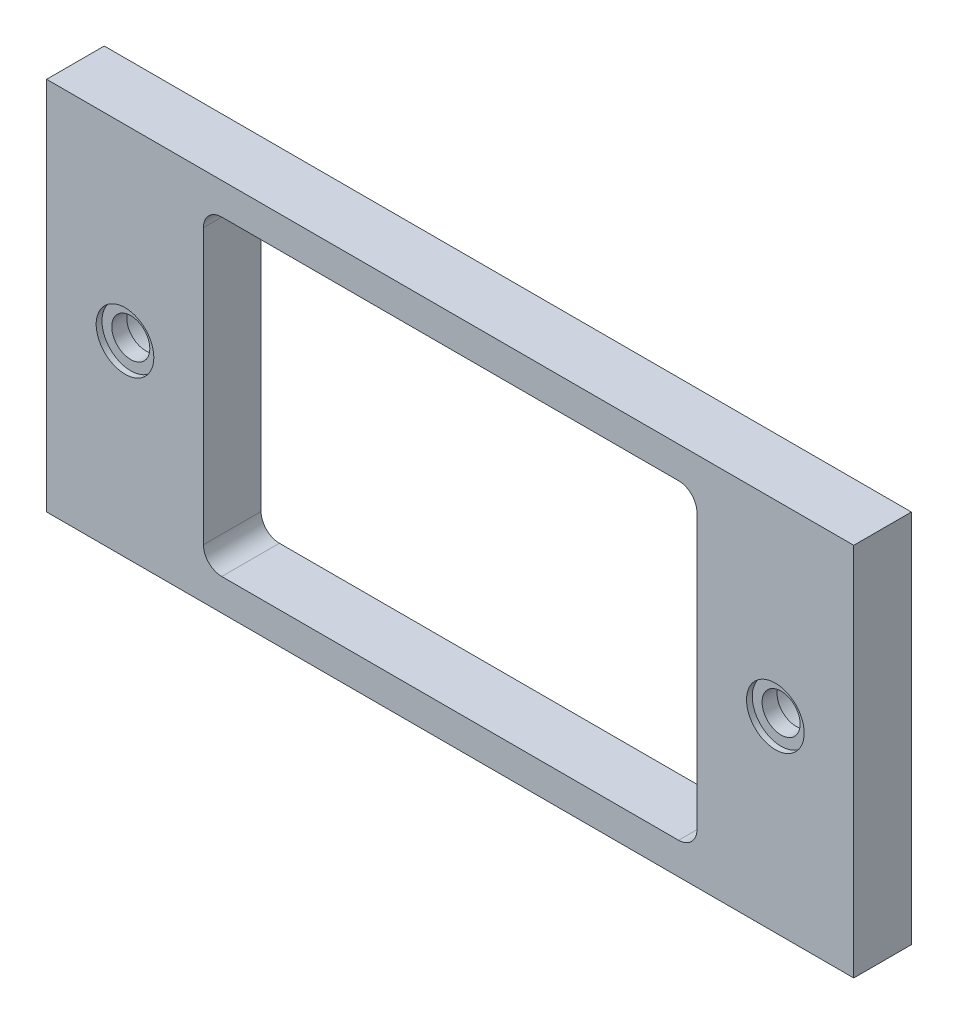
ISO-10303-21;
HEADER;
FILE_DESCRIPTION(('STEP AP214'),'2;1');
FILE_NAME('part.step','',(''),(''),'','','');
FILE_SCHEMA(('AUTOMOTIVE_DESIGN { 1 0 10303 214 1 1 1 1 }'));
ENDSEC;
DATA;
#1=APPLICATION_CONTEXT('core data for automotive mechanical design processes');
#2=APPLICATION_PROTOCOL_DEFINITION('international standard','automotive_design',2000,#1);
#3=PRODUCT_CONTEXT('',#1,'mechanical');
#4=PRODUCT('Part','Part','',(#3));
#5=PRODUCT_RELATED_PRODUCT_CATEGORY('part','',(#4));
#6=PRODUCT_DEFINITION_FORMATION('','',#4);
#7=PRODUCT_DEFINITION_CONTEXT('part definition',#1,'design');
#8=PRODUCT_DEFINITION('design','',#6,#7);
#9=PRODUCT_DEFINITION_SHAPE('','',#8);
#10=(LENGTH_UNIT() NAMED_UNIT(*) SI_UNIT(.MILLI.,.METRE.));
#11=(NAMED_UNIT(*) PLANE_ANGLE_UNIT() SI_UNIT($,.RADIAN.));
#12=(NAMED_UNIT(*) SI_UNIT($,.STERADIAN.) SOLID_ANGLE_UNIT());
#13=UNCERTAINTY_MEASURE_WITH_UNIT(LENGTH_MEASURE(1.E-05),#10,'distance_accuracy_value','');
#14=(GEOMETRIC_REPRESENTATION_CONTEXT(3) GLOBAL_UNCERTAINTY_ASSIGNED_CONTEXT((#13)) GLOBAL_UNIT_ASSIGNED_CONTEXT((#10,
#11,#12)) REPRESENTATION_CONTEXT('',''));
#15=CARTESIAN_POINT('',(0.,0.,0.));
#16=DIRECTION('',(0.,0.,1.));
#17=DIRECTION('',(1.,0.,0.));
#18=AXIS2_PLACEMENT_3D('',#15,#16,#17);
#19=CARTESIAN_POINT('',(126.4,32.5,0.));
#20=DIRECTION('',(0.,0.,-1.));
#21=DIRECTION('',(-1.,0.,0.));
#22=AXIS2_PLACEMENT_3D('',#19,#20,#21);
#23=CYLINDRICAL_SURFACE('',#22,3.3);
#24=CARTESIAN_POINT('',(126.4,32.5,6.4));
#25=DIRECTION('',(0.,0.,-1.));
#26=DIRECTION('',(-1.,0.,0.));
#27=AXIS2_PLACEMENT_3D('',#24,#25,#26);
#28=CIRCLE('',#27,3.3);
#29=CARTESIAN_POINT('',(123.1,32.5,6.4));
#30=VERTEX_POINT('',#29);
#31=EDGE_CURVE('E209',#30,#30,#28,.T.);
#32=ORIENTED_EDGE('',*,*,#31,.T.);
#33=EDGE_LOOP('',(#32));
#34=FACE_BOUND('',#33,.T.);
#35=CARTESIAN_POINT('',(126.4,32.5,9.));
#36=DIRECTION('',(0.,0.,1.));
#37=DIRECTION('',(1.,0.,0.));
#38=AXIS2_PLACEMENT_3D('',#35,#36,#37);
#39=CIRCLE('',#38,3.3);
#40=CARTESIAN_POINT('',(129.7,32.5,9.));
#41=VERTEX_POINT('',#40);
#42=EDGE_CURVE('E39',#41,#41,#39,.F.);
#43=ORIENTED_EDGE('',*,*,#42,.F.);
#44=EDGE_LOOP('',(#43));
#45=FACE_BOUND('',#44,.T.);
#46=ADVANCED_FACE('F35',(#34,#45),#23,.F.);
#47=CARTESIAN_POINT('',(13.6,32.5,0.));
#48=DIRECTION('',(0.,0.,-1.));
#49=DIRECTION('',(-1.,0.,0.));
#50=AXIS2_PLACEMENT_3D('',#47,#48,#49);
#51=CYLINDRICAL_SURFACE('',#50,3.3);
#52=CARTESIAN_POINT('',(13.6,32.5,6.4));
#53=DIRECTION('',(0.,0.,-1.));
#54=DIRECTION('',(-1.,0.,0.));
#55=AXIS2_PLACEMENT_3D('',#52,#53,#54);
#56=CIRCLE('',#55,3.3);
#57=CARTESIAN_POINT('',(10.3,32.5,6.4));
#58=VERTEX_POINT('',#57);
#59=EDGE_CURVE('E218',#58,#58,#56,.T.);
#60=ORIENTED_EDGE('',*,*,#59,.T.);
#61=EDGE_LOOP('',(#60));
#62=FACE_BOUND('',#61,.T.);
#63=CARTESIAN_POINT('',(13.6,32.5,9.));
#64=DIRECTION('',(0.,0.,1.));
#65=DIRECTION('',(1.,0.,0.));
#66=AXIS2_PLACEMENT_3D('',#63,#64,#65);
#67=CIRCLE('',#66,3.3);
#68=CARTESIAN_POINT('',(16.9,32.5,9.));
#69=VERTEX_POINT('',#68);
#70=EDGE_CURVE('E187',#69,#69,#67,.F.);
#71=ORIENTED_EDGE('',*,*,#70,.F.);
#72=EDGE_LOOP('',(#71));
#73=FACE_BOUND('',#72,.T.);
#74=ADVANCED_FACE('F270',(#62,#73),#51,.F.);
#75=CARTESIAN_POINT('',(0.,0.,10.));
#76=DIRECTION('',(1.,0.,0.));
#77=DIRECTION('',(0.,0.,-1.));
#78=AXIS2_PLACEMENT_3D('',#75,#76,#77);
#79=PLANE('',#78);
#80=DIRECTION('',(0.,-1.,0.));
#81=VECTOR('',#80,1.);
#82=CARTESIAN_POINT('',(0.,0.,0.));
#83=LINE('',#82,#81);
#84=CARTESIAN_POINT('',(0.,65.,0.));
#85=VERTEX_POINT('',#84);
#86=CARTESIAN_POINT('',(0.,0.,0.));
#87=VERTEX_POINT('',#86);
#88=EDGE_CURVE('E151',#85,#87,#83,.T.);
#89=ORIENTED_EDGE('',*,*,#88,.T.);
#90=DIRECTION('',(0.,0.,-1.));
#91=VECTOR('',#90,1.);
#92=CARTESIAN_POINT('',(0.,0.,10.));
#93=LINE('',#92,#91);
#94=CARTESIAN_POINT('',(0.,0.,10.));
#95=VERTEX_POINT('',#94);
#96=EDGE_CURVE('E131',#95,#87,#93,.T.);
#97=ORIENTED_EDGE('',*,*,#96,.F.);
#98=DIRECTION('',(0.,-1.,0.));
#99=VECTOR('',#98,1.);
#100=CARTESIAN_POINT('',(0.,0.,10.));
#101=LINE('',#100,#99);
#102=CARTESIAN_POINT('',(0.,65.,10.));
#103=VERTEX_POINT('',#102);
#104=EDGE_CURVE('E138',#103,#95,#101,.T.);
#105=ORIENTED_EDGE('',*,*,#104,.F.);
#106=DIRECTION('',(0.,0.,-1.));
#107=VECTOR('',#106,1.);
#108=CARTESIAN_POINT('',(0.,65.,10.));
#109=LINE('',#108,#107);
#110=EDGE_CURVE('E244',#103,#85,#109,.T.);
#111=ORIENTED_EDGE('',*,*,#110,.T.);
#112=EDGE_LOOP('',(#89,#97,#105,#111));
#113=FACE_BOUND('',#112,.T.);
#114=ADVANCED_FACE('F149',(#113),#79,.F.);
#115=CARTESIAN_POINT('',(0.,0.,10.));
#116=DIRECTION('',(0.,1.,0.));
#117=DIRECTION('',(0.,0.,1.));
#118=AXIS2_PLACEMENT_3D('',#115,#116,#117);
#119=PLANE('',#118);
#120=DIRECTION('',(1.,0.,0.));
#121=VECTOR('',#120,1.);
#122=CARTESIAN_POINT('',(0.,0.,0.));
#123=LINE('',#122,#121);
#124=CARTESIAN_POINT('',(140.,0.,0.));
#125=VERTEX_POINT('',#124);
#126=EDGE_CURVE('E246',#87,#125,#123,.T.);
#127=ORIENTED_EDGE('',*,*,#126,.T.);
#128=DIRECTION('',(0.,0.,-1.));
#129=VECTOR('',#128,1.);
#130=CARTESIAN_POINT('',(140.,0.,10.));
#131=LINE('',#130,#129);
#132=CARTESIAN_POINT('',(140.,0.,10.));
#133=VERTEX_POINT('',#132);
#134=EDGE_CURVE('E134',#133,#125,#131,.T.);
#135=ORIENTED_EDGE('',*,*,#134,.F.);
#136=DIRECTION('',(1.,0.,0.));
#137=VECTOR('',#136,1.);
#138=CARTESIAN_POINT('',(0.,0.,10.));
#139=LINE('',#138,#137);
#140=EDGE_CURVE('E127',#95,#133,#139,.T.);
#141=ORIENTED_EDGE('',*,*,#140,.F.);
#142=ORIENTED_EDGE('',*,*,#96,.T.);
#143=EDGE_LOOP('',(#127,#135,#141,#142));
#144=FACE_BOUND('',#143,.T.);
#145=ADVANCED_FACE('F129',(#144),#119,.F.);
#146=CARTESIAN_POINT('',(140.,0.,10.));
#147=DIRECTION('',(-1.,0.,0.));
#148=DIRECTION('',(0.,0.,1.));
#149=AXIS2_PLACEMENT_3D('',#146,#147,#148);
#150=PLANE('',#149);
#151=DIRECTION('',(0.,1.,0.));
#152=VECTOR('',#151,1.);
#153=CARTESIAN_POINT('',(140.,0.,0.));
#154=LINE('',#153,#152);
#155=CARTESIAN_POINT('',(140.,65.,0.));
#156=VERTEX_POINT('',#155);
#157=EDGE_CURVE('E248',#125,#156,#154,.T.);
#158=ORIENTED_EDGE('',*,*,#157,.T.);
#159=DIRECTION('',(0.,0.,-1.));
#160=VECTOR('',#159,1.);
#161=CARTESIAN_POINT('',(140.,65.,10.));
#162=LINE('',#161,#160);
#163=CARTESIAN_POINT('',(140.,65.,10.));
#164=VERTEX_POINT('',#163);
#165=EDGE_CURVE('E156',#164,#156,#162,.T.);
#166=ORIENTED_EDGE('',*,*,#165,.F.);
#167=DIRECTION('',(0.,1.,0.));
#168=VECTOR('',#167,1.);
#169=CARTESIAN_POINT('',(140.,0.,10.));
#170=LINE('',#169,#168);
#171=EDGE_CURVE('E137',#133,#164,#170,.T.);
#172=ORIENTED_EDGE('',*,*,#171,.F.);
#173=ORIENTED_EDGE('',*,*,#134,.T.);
#174=EDGE_LOOP('',(#158,#166,#172,#173));
#175=FACE_BOUND('',#174,.T.);
#176=ADVANCED_FACE('F260',(#175),#150,.F.);
#177=CARTESIAN_POINT('',(0.,65.,10.));
#178=DIRECTION('',(0.,-1.,0.));
#179=DIRECTION('',(0.,0.,-1.));
#180=AXIS2_PLACEMENT_3D('',#177,#178,#179);
#181=PLANE('',#180);
#182=DIRECTION('',(-1.,0.,0.));
#183=VECTOR('',#182,1.);
#184=CARTESIAN_POINT('',(0.,65.,0.));
#185=LINE('',#184,#183);
#186=EDGE_CURVE('E147',#156,#85,#185,.T.);
#187=ORIENTED_EDGE('',*,*,#186,.T.);
#188=ORIENTED_EDGE('',*,*,#110,.F.);
#189=DIRECTION('',(-1.,0.,0.));
#190=VECTOR('',#189,1.);
#191=CARTESIAN_POINT('',(0.,65.,10.));
#192=LINE('',#191,#190);
#193=EDGE_CURVE('E143',#164,#103,#192,.T.);
#194=ORIENTED_EDGE('',*,*,#193,.F.);
#195=ORIENTED_EDGE('',*,*,#165,.T.);
#196=EDGE_LOOP('',(#187,#188,#194,#195));
#197=FACE_BOUND('',#196,.T.);
#198=ADVANCED_FACE('F255',(#197),#181,.F.);
#199=CARTESIAN_POINT('',(0.,0.,10.));
#200=DIRECTION('',(0.,0.,-1.));
#201=DIRECTION('',(-1.,0.,0.));
#202=AXIS2_PLACEMENT_3D('',#199,#200,#201);
#203=PLANE('',#202);
#204=CARTESIAN_POINT('',(126.4,32.5,10.));
#205=DIRECTION('',(0.,0.,1.));
#206=DIRECTION('',(1.,0.,0.));
#207=AXIS2_PLACEMENT_3D('',#204,#205,#206);
#208=CIRCLE('',#207,5.00000000000002);
#209=CARTESIAN_POINT('',(131.4,32.5,10.));
#210=VERTEX_POINT('',#209);
#211=EDGE_CURVE('E204',#210,#210,#208,.T.);
#212=ORIENTED_EDGE('',*,*,#211,.F.);
#213=EDGE_LOOP('',(#212));
#214=FACE_BOUND('',#213,.T.);
#215=CARTESIAN_POINT('',(13.6,32.5,10.));
#216=DIRECTION('',(0.,0.,1.));
#217=DIRECTION('',(1.,0.,0.));
#218=AXIS2_PLACEMENT_3D('',#215,#216,#217);
#219=CIRCLE('',#218,5.);
#220=CARTESIAN_POINT('',(18.6,32.5,10.));
#221=VERTEX_POINT('',#220);
#222=EDGE_CURVE('E197',#221,#221,#219,.T.);
#223=ORIENTED_EDGE('',*,*,#222,.F.);
#224=EDGE_LOOP('',(#223));
#225=FACE_BOUND('',#224,.T.);
#226=DIRECTION('',(1.,0.,0.));
#227=VECTOR('',#226,1.);
#228=CARTESIAN_POINT('',(27.2,5.50000000000001,10.));
#229=LINE('',#228,#227);
#230=CARTESIAN_POINT('',(30.38,5.50000000000001,10.));
#231=VERTEX_POINT('',#230);
#232=CARTESIAN_POINT('',(109.62,5.50000000000001,10.));
#233=VERTEX_POINT('',#232);
#234=EDGE_CURVE('E235',#231,#233,#229,.T.);
#235=ORIENTED_EDGE('',*,*,#234,.F.);
#236=CARTESIAN_POINT('',(30.38,8.68000000000001,10.));
#237=DIRECTION('',(0.,0.,-1.));
#238=DIRECTION('',(-1.,0.,0.));
#239=AXIS2_PLACEMENT_3D('',#236,#237,#238);
#240=CIRCLE('',#239,3.18);
#241=CARTESIAN_POINT('',(27.2,8.68000000000001,10.));
#242=VERTEX_POINT('',#241);
#243=EDGE_CURVE('E180',#231,#242,#240,.T.);
#244=ORIENTED_EDGE('',*,*,#243,.T.);
#245=DIRECTION('',(0.,-1.,0.));
#246=VECTOR('',#245,1.);
#247=CARTESIAN_POINT('',(27.2,59.5,10.));
#248=LINE('',#247,#246);
#249=CARTESIAN_POINT('',(27.2,56.32,10.));
#250=VERTEX_POINT('',#249);
#251=EDGE_CURVE('E221',#250,#242,#248,.T.);
#252=ORIENTED_EDGE('',*,*,#251,.F.);
#253=CARTESIAN_POINT('',(30.38,56.32,10.));
#254=DIRECTION('',(0.,0.,-1.));
#255=DIRECTION('',(-1.,0.,0.));
#256=AXIS2_PLACEMENT_3D('',#253,#254,#255);
#257=CIRCLE('',#256,3.18);
#258=CARTESIAN_POINT('',(30.38,59.5,10.));
#259=VERTEX_POINT('',#258);
#260=EDGE_CURVE('E44',#250,#259,#257,.T.);
#261=ORIENTED_EDGE('',*,*,#260,.T.);
#262=DIRECTION('',(-1.,0.,0.));
#263=VECTOR('',#262,1.);
#264=CARTESIAN_POINT('',(27.2,59.5,10.));
#265=LINE('',#264,#263);
#266=CARTESIAN_POINT('',(109.62,59.5,10.));
#267=VERTEX_POINT('',#266);
#268=EDGE_CURVE('E226',#267,#259,#265,.T.);
#269=ORIENTED_EDGE('',*,*,#268,.F.);
#270=CARTESIAN_POINT('',(109.62,56.32,10.));
#271=DIRECTION('',(0.,0.,-1.));
#272=DIRECTION('',(-1.,0.,0.));
#273=AXIS2_PLACEMENT_3D('',#270,#271,#272);
#274=CIRCLE('',#273,3.18);
#275=CARTESIAN_POINT('',(112.8,56.32,10.));
#276=VERTEX_POINT('',#275);
#277=EDGE_CURVE('E184',#267,#276,#274,.T.);
#278=ORIENTED_EDGE('',*,*,#277,.T.);
#279=DIRECTION('',(0.,1.,0.));
#280=VECTOR('',#279,1.);
#281=CARTESIAN_POINT('',(112.8,59.5,10.));
#282=LINE('',#281,#280);
#283=CARTESIAN_POINT('',(112.8,8.68000000000001,10.));
#284=VERTEX_POINT('',#283);
#285=EDGE_CURVE('E238',#284,#276,#282,.T.);
#286=ORIENTED_EDGE('',*,*,#285,.F.);
#287=CARTESIAN_POINT('',(109.62,8.68000000000001,10.));
#288=DIRECTION('',(0.,0.,-1.));
#289=DIRECTION('',(-1.,0.,0.));
#290=AXIS2_PLACEMENT_3D('',#287,#288,#289);
#291=CIRCLE('',#290,3.18);
#292=EDGE_CURVE('E176',#284,#233,#291,.T.);
#293=ORIENTED_EDGE('',*,*,#292,.T.);
#294=EDGE_LOOP('',(#235,#244,#252,#261,#269,#278,#286,#293));
#295=FACE_BOUND('',#294,.T.);
#296=ORIENTED_EDGE('',*,*,#104,.T.);
#297=ORIENTED_EDGE('',*,*,#140,.T.);
#298=ORIENTED_EDGE('',*,*,#171,.T.);
#299=ORIENTED_EDGE('',*,*,#193,.T.);
#300=EDGE_LOOP('',(#296,#297,#298,#299));
#301=FACE_BOUND('',#300,.T.);
#302=ADVANCED_FACE('F141',(#214,#225,#295,#301),#203,.F.);
#303=CARTESIAN_POINT('',(0.,0.,0.));
#304=DIRECTION('',(0.,0.,-1.));
#305=DIRECTION('',(-1.,0.,0.));
#306=AXIS2_PLACEMENT_3D('',#303,#304,#305);
#307=PLANE('',#306);
#308=CARTESIAN_POINT('',(126.4,32.5,0.));
#309=DIRECTION('',(0.,0.,-1.));
#310=DIRECTION('',(-1.,0.,0.));
#311=AXIS2_PLACEMENT_3D('',#308,#309,#310);
#312=CIRCLE('',#311,5.50000000000001);
#313=CARTESIAN_POINT('',(120.9,32.5,0.));
#314=VERTEX_POINT('',#313);
#315=EDGE_CURVE('E189',#314,#314,#312,.T.);
#316=ORIENTED_EDGE('',*,*,#315,.F.);
#317=EDGE_LOOP('',(#316));
#318=FACE_BOUND('',#317,.T.);
#319=CARTESIAN_POINT('',(13.6,32.5,0.));
#320=DIRECTION('',(0.,0.,-1.));
#321=DIRECTION('',(-1.,0.,0.));
#322=AXIS2_PLACEMENT_3D('',#319,#320,#321);
#323=CIRCLE('',#322,5.5);
#324=CARTESIAN_POINT('',(8.09999999999997,32.5,0.));
#325=VERTEX_POINT('',#324);
#326=EDGE_CURVE('E212',#325,#325,#323,.T.);
#327=ORIENTED_EDGE('',*,*,#326,.F.);
#328=EDGE_LOOP('',(#327));
#329=FACE_BOUND('',#328,.T.);
#330=DIRECTION('',(-1.,0.,0.));
#331=VECTOR('',#330,1.);
#332=CARTESIAN_POINT('',(27.2,59.5,0.));
#333=LINE('',#332,#331);
#334=CARTESIAN_POINT('',(109.62,59.5,0.));
#335=VERTEX_POINT('',#334);
#336=CARTESIAN_POINT('',(30.38,59.5,0.));
#337=VERTEX_POINT('',#336);
#338=EDGE_CURVE('E231',#335,#337,#333,.T.);
#339=ORIENTED_EDGE('',*,*,#338,.T.);
#340=CARTESIAN_POINT('',(30.38,56.32,0.));
#341=DIRECTION('',(0.,0.,-1.));
#342=DIRECTION('',(-1.,0.,0.));
#343=AXIS2_PLACEMENT_3D('',#340,#341,#342);
#344=CIRCLE('',#343,3.18);
#345=CARTESIAN_POINT('',(27.2,56.32,0.));
#346=VERTEX_POINT('',#345);
#347=EDGE_CURVE('E11',#337,#346,#344,.F.);
#348=ORIENTED_EDGE('',*,*,#347,.T.);
#349=DIRECTION('',(0.,-1.,0.));
#350=VECTOR('',#349,1.);
#351=CARTESIAN_POINT('',(27.2,59.5,0.));
#352=LINE('',#351,#350);
#353=CARTESIAN_POINT('',(27.2,8.68000000000001,0.));
#354=VERTEX_POINT('',#353);
#355=EDGE_CURVE('E222',#346,#354,#352,.T.);
#356=ORIENTED_EDGE('',*,*,#355,.T.);
#357=CARTESIAN_POINT('',(30.38,8.68000000000001,0.));
#358=DIRECTION('',(0.,0.,-1.));
#359=DIRECTION('',(-1.,0.,0.));
#360=AXIS2_PLACEMENT_3D('',#357,#358,#359);
#361=CIRCLE('',#360,3.18);
#362=CARTESIAN_POINT('',(30.38,5.50000000000001,0.));
#363=VERTEX_POINT('',#362);
#364=EDGE_CURVE('E182',#354,#363,#361,.F.);
#365=ORIENTED_EDGE('',*,*,#364,.T.);
#366=DIRECTION('',(1.,0.,0.));
#367=VECTOR('',#366,1.);
#368=CARTESIAN_POINT('',(27.2,5.50000000000001,0.));
#369=LINE('',#368,#367);
#370=CARTESIAN_POINT('',(109.62,5.50000000000001,0.));
#371=VERTEX_POINT('',#370);
#372=EDGE_CURVE('E225',#363,#371,#369,.T.);
#373=ORIENTED_EDGE('',*,*,#372,.T.);
#374=CARTESIAN_POINT('',(109.62,8.68000000000001,0.));
#375=DIRECTION('',(0.,0.,-1.));
#376=DIRECTION('',(-1.,0.,0.));
#377=AXIS2_PLACEMENT_3D('',#374,#375,#376);
#378=CIRCLE('',#377,3.18);
#379=CARTESIAN_POINT('',(112.8,8.68000000000001,0.));
#380=VERTEX_POINT('',#379);
#381=EDGE_CURVE('E178',#371,#380,#378,.F.);
#382=ORIENTED_EDGE('',*,*,#381,.T.);
#383=DIRECTION('',(0.,1.,0.));
#384=VECTOR('',#383,1.);
#385=CARTESIAN_POINT('',(112.8,59.5,0.));
#386=LINE('',#385,#384);
#387=CARTESIAN_POINT('',(112.8,56.32,0.));
#388=VERTEX_POINT('',#387);
#389=EDGE_CURVE('E229',#380,#388,#386,.T.);
#390=ORIENTED_EDGE('',*,*,#389,.T.);
#391=CARTESIAN_POINT('',(109.62,56.32,0.));
#392=DIRECTION('',(0.,0.,-1.));
#393=DIRECTION('',(-1.,0.,0.));
#394=AXIS2_PLACEMENT_3D('',#391,#392,#393);
#395=CIRCLE('',#394,3.18);
#396=EDGE_CURVE('E59',#388,#335,#395,.F.);
#397=ORIENTED_EDGE('',*,*,#396,.T.);
#398=EDGE_LOOP('',(#339,#348,#356,#365,#373,#382,#390,#397));
#399=FACE_BOUND('',#398,.T.);
#400=ORIENTED_EDGE('',*,*,#88,.F.);
#401=ORIENTED_EDGE('',*,*,#186,.F.);
#402=ORIENTED_EDGE('',*,*,#157,.F.);
#403=ORIENTED_EDGE('',*,*,#126,.F.);
#404=EDGE_LOOP('',(#400,#401,#402,#403));
#405=FACE_BOUND('',#404,.T.);
#406=ADVANCED_FACE('F259',(#318,#329,#399,#405),#307,.T.);
#407=CARTESIAN_POINT('',(27.2,59.5,0.));
#408=DIRECTION('',(-1.,0.,0.));
#409=DIRECTION('',(0.,0.,1.));
#410=AXIS2_PLACEMENT_3D('',#407,#408,#409);
#411=PLANE('',#410);
#412=ORIENTED_EDGE('',*,*,#251,.T.);
#413=DIRECTION('',(0.,0.,1.));
#414=VECTOR('',#413,1.);
#415=CARTESIAN_POINT('',(27.2,8.68000000000001,0.));
#416=LINE('',#415,#414);
#417=EDGE_CURVE('E170',#242,#354,#416,.F.);
#418=ORIENTED_EDGE('',*,*,#417,.T.);
#419=ORIENTED_EDGE('',*,*,#355,.F.);
#420=DIRECTION('',(0.,0.,1.));
#421=VECTOR('',#420,1.);
#422=CARTESIAN_POINT('',(27.2,56.32,10.));
#423=LINE('',#422,#421);
#424=EDGE_CURVE('E167',#346,#250,#423,.T.);
#425=ORIENTED_EDGE('',*,*,#424,.T.);
#426=EDGE_LOOP('',(#412,#418,#419,#425));
#427=FACE_BOUND('',#426,.T.);
#428=ADVANCED_FACE('F295',(#427),#411,.F.);
#429=CARTESIAN_POINT('',(27.2,59.5,0.));
#430=DIRECTION('',(0.,1.,0.));
#431=DIRECTION('',(-1.,0.,0.));
#432=AXIS2_PLACEMENT_3D('',#429,#430,#431);
#433=PLANE('',#432);
#434=ORIENTED_EDGE('',*,*,#338,.F.);
#435=DIRECTION('',(0.,0.,1.));
#436=VECTOR('',#435,1.);
#437=CARTESIAN_POINT('',(109.62,59.5,10.));
#438=LINE('',#437,#436);
#439=EDGE_CURVE('E173',#335,#267,#438,.T.);
#440=ORIENTED_EDGE('',*,*,#439,.T.);
#441=ORIENTED_EDGE('',*,*,#268,.T.);
#442=DIRECTION('',(0.,0.,1.));
#443=VECTOR('',#442,1.);
#444=CARTESIAN_POINT('',(30.38,59.5,0.));
#445=LINE('',#444,#443);
#446=EDGE_CURVE('E52',#259,#337,#445,.F.);
#447=ORIENTED_EDGE('',*,*,#446,.T.);
#448=EDGE_LOOP('',(#434,#440,#441,#447));
#449=FACE_BOUND('',#448,.T.);
#450=ADVANCED_FACE('F291',(#449),#433,.F.);
#451=CARTESIAN_POINT('',(112.8,59.5,0.));
#452=DIRECTION('',(1.,0.,0.));
#453=DIRECTION('',(0.,0.,-1.));
#454=AXIS2_PLACEMENT_3D('',#451,#452,#453);
#455=PLANE('',#454);
#456=ORIENTED_EDGE('',*,*,#389,.F.);
#457=DIRECTION('',(0.,0.,1.));
#458=VECTOR('',#457,1.);
#459=CARTESIAN_POINT('',(112.8,8.68000000000001,10.));
#460=LINE('',#459,#458);
#461=EDGE_CURVE('E154',#380,#284,#460,.T.);
#462=ORIENTED_EDGE('',*,*,#461,.T.);
#463=ORIENTED_EDGE('',*,*,#285,.T.);
#464=DIRECTION('',(0.,0.,1.));
#465=VECTOR('',#464,1.);
#466=CARTESIAN_POINT('',(112.8,56.32,0.));
#467=LINE('',#466,#465);
#468=EDGE_CURVE('E152',#276,#388,#467,.F.);
#469=ORIENTED_EDGE('',*,*,#468,.T.);
#470=EDGE_LOOP('',(#456,#462,#463,#469));
#471=FACE_BOUND('',#470,.T.);
#472=ADVANCED_FACE('F294',(#471),#455,.F.);
#473=CARTESIAN_POINT('',(27.2,5.50000000000001,0.));
#474=DIRECTION('',(0.,-1.,0.));
#475=DIRECTION('',(0.,0.,-1.));
#476=AXIS2_PLACEMENT_3D('',#473,#474,#475);
#477=PLANE('',#476);
#478=ORIENTED_EDGE('',*,*,#234,.T.);
#479=DIRECTION('',(0.,0.,1.));
#480=VECTOR('',#479,1.);
#481=CARTESIAN_POINT('',(109.62,5.50000000000001,0.));
#482=LINE('',#481,#480);
#483=EDGE_CURVE('E165',#233,#371,#482,.F.);
#484=ORIENTED_EDGE('',*,*,#483,.T.);
#485=ORIENTED_EDGE('',*,*,#372,.F.);
#486=DIRECTION('',(0.,0.,1.));
#487=VECTOR('',#486,1.);
#488=CARTESIAN_POINT('',(30.38,5.50000000000001,10.));
#489=LINE('',#488,#487);
#490=EDGE_CURVE('E162',#363,#231,#489,.T.);
#491=ORIENTED_EDGE('',*,*,#490,.T.);
#492=EDGE_LOOP('',(#478,#484,#485,#491));
#493=FACE_BOUND('',#492,.T.);
#494=ADVANCED_FACE('F298',(#493),#477,.F.);
#495=CARTESIAN_POINT('',(109.62,8.68000000000001,0.));
#496=DIRECTION('',(0.,0.,-1.));
#497=DIRECTION('',(-1.,0.,0.));
#498=AXIS2_PLACEMENT_3D('',#495,#496,#497);
#499=CYLINDRICAL_SURFACE('',#498,3.18);
#500=ORIENTED_EDGE('',*,*,#381,.F.);
#501=ORIENTED_EDGE('',*,*,#483,.F.);
#502=ORIENTED_EDGE('',*,*,#292,.F.);
#503=ORIENTED_EDGE('',*,*,#461,.F.);
#504=EDGE_LOOP('',(#500,#501,#502,#503));
#505=FACE_BOUND('',#504,.T.);
#506=ADVANCED_FACE('F302',(#505),#499,.F.);
#507=CARTESIAN_POINT('',(30.38,8.68000000000001,0.));
#508=DIRECTION('',(0.,0.,-1.));
#509=DIRECTION('',(-1.,0.,0.));
#510=AXIS2_PLACEMENT_3D('',#507,#508,#509);
#511=CYLINDRICAL_SURFACE('',#510,3.18);
#512=ORIENTED_EDGE('',*,*,#364,.F.);
#513=ORIENTED_EDGE('',*,*,#417,.F.);
#514=ORIENTED_EDGE('',*,*,#243,.F.);
#515=ORIENTED_EDGE('',*,*,#490,.F.);
#516=EDGE_LOOP('',(#512,#513,#514,#515));
#517=FACE_BOUND('',#516,.T.);
#518=ADVANCED_FACE('F330',(#517),#511,.F.);
#519=CARTESIAN_POINT('',(109.62,56.32,0.));
#520=DIRECTION('',(0.,0.,-1.));
#521=DIRECTION('',(-1.,0.,0.));
#522=AXIS2_PLACEMENT_3D('',#519,#520,#521);
#523=CYLINDRICAL_SURFACE('',#522,3.18);
#524=ORIENTED_EDGE('',*,*,#396,.F.);
#525=ORIENTED_EDGE('',*,*,#468,.F.);
#526=ORIENTED_EDGE('',*,*,#277,.F.);
#527=ORIENTED_EDGE('',*,*,#439,.F.);
#528=EDGE_LOOP('',(#524,#525,#526,#527));
#529=FACE_BOUND('',#528,.T.);
#530=ADVANCED_FACE('F340',(#529),#523,.F.);
#531=CARTESIAN_POINT('',(30.38,56.32,0.));
#532=DIRECTION('',(0.,0.,-1.));
#533=DIRECTION('',(-1.,0.,0.));
#534=AXIS2_PLACEMENT_3D('',#531,#532,#533);
#535=CYLINDRICAL_SURFACE('',#534,3.18);
#536=ORIENTED_EDGE('',*,*,#347,.F.);
#537=ORIENTED_EDGE('',*,*,#446,.F.);
#538=ORIENTED_EDGE('',*,*,#260,.F.);
#539=ORIENTED_EDGE('',*,*,#424,.F.);
#540=EDGE_LOOP('',(#536,#537,#538,#539));
#541=FACE_BOUND('',#540,.T.);
#542=ADVANCED_FACE('F37',(#541),#535,.F.);
#543=CARTESIAN_POINT('',(16.9,32.5,6.4));
#544=DIRECTION('',(0.,0.,1.));
#545=DIRECTION('',(1.,0.,0.));
#546=AXIS2_PLACEMENT_3D('',#543,#544,#545);
#547=PLANE('',#546);
#548=ORIENTED_EDGE('',*,*,#59,.F.);
#549=EDGE_LOOP('',(#548));
#550=FACE_BOUND('',#549,.T.);
#551=CARTESIAN_POINT('',(13.6,32.5,6.4));
#552=DIRECTION('',(0.,0.,-1.));
#553=DIRECTION('',(-1.,0.,0.));
#554=AXIS2_PLACEMENT_3D('',#551,#552,#553);
#555=CIRCLE('',#554,5.5);
#556=CARTESIAN_POINT('',(8.09999999999997,32.5,6.4));
#557=VERTEX_POINT('',#556);
#558=EDGE_CURVE('E215',#557,#557,#555,.T.);
#559=ORIENTED_EDGE('',*,*,#558,.T.);
#560=EDGE_LOOP('',(#559));
#561=FACE_BOUND('',#560,.T.);
#562=ADVANCED_FACE('F286',(#550,#561),#547,.F.);
#563=CARTESIAN_POINT('',(13.6,32.5,0.));
#564=DIRECTION('',(0.,0.,-1.));
#565=DIRECTION('',(-1.,0.,0.));
#566=AXIS2_PLACEMENT_3D('',#563,#564,#565);
#567=CYLINDRICAL_SURFACE('',#566,5.5);
#568=ORIENTED_EDGE('',*,*,#558,.F.);
#569=EDGE_LOOP('',(#568));
#570=FACE_BOUND('',#569,.T.);
#571=ORIENTED_EDGE('',*,*,#326,.T.);
#572=EDGE_LOOP('',(#571));
#573=FACE_BOUND('',#572,.T.);
#574=ADVANCED_FACE('F283',(#570,#573),#567,.F.);
#575=CARTESIAN_POINT('',(129.7,32.5,6.4));
#576=DIRECTION('',(0.,0.,1.));
#577=DIRECTION('',(1.,0.,0.));
#578=AXIS2_PLACEMENT_3D('',#575,#576,#577);
#579=PLANE('',#578);
#580=ORIENTED_EDGE('',*,*,#31,.F.);
#581=EDGE_LOOP('',(#580));
#582=FACE_BOUND('',#581,.T.);
#583=CARTESIAN_POINT('',(126.4,32.5,6.4));
#584=DIRECTION('',(0.,0.,-1.));
#585=DIRECTION('',(-1.,0.,0.));
#586=AXIS2_PLACEMENT_3D('',#583,#584,#585);
#587=CIRCLE('',#586,5.50000000000001);
#588=CARTESIAN_POINT('',(120.9,32.5,6.4));
#589=VERTEX_POINT('',#588);
#590=EDGE_CURVE('E194',#589,#589,#587,.T.);
#591=ORIENTED_EDGE('',*,*,#590,.T.);
#592=EDGE_LOOP('',(#591));
#593=FACE_BOUND('',#592,.T.);
#594=ADVANCED_FACE('F281',(#582,#593),#579,.F.);
#595=CARTESIAN_POINT('',(126.4,32.5,0.));
#596=DIRECTION('',(0.,0.,-1.));
#597=DIRECTION('',(-1.,0.,0.));
#598=AXIS2_PLACEMENT_3D('',#595,#596,#597);
#599=CYLINDRICAL_SURFACE('',#598,5.50000000000001);
#600=ORIENTED_EDGE('',*,*,#590,.F.);
#601=EDGE_LOOP('',(#600));
#602=FACE_BOUND('',#601,.T.);
#603=ORIENTED_EDGE('',*,*,#315,.T.);
#604=EDGE_LOOP('',(#603));
#605=FACE_BOUND('',#604,.T.);
#606=ADVANCED_FACE('F441',(#602,#605),#599,.F.);
#607=CARTESIAN_POINT('',(13.6,32.5,9.));
#608=DIRECTION('',(0.,0.,1.));
#609=DIRECTION('',(1.,0.,0.));
#610=AXIS2_PLACEMENT_3D('',#607,#608,#609);
#611=PLANE('',#610);
#612=CARTESIAN_POINT('',(13.6,32.5,9.));
#613=DIRECTION('',(0.,0.,1.));
#614=DIRECTION('',(1.,0.,0.));
#615=AXIS2_PLACEMENT_3D('',#612,#613,#614);
#616=CIRCLE('',#615,5.);
#617=CARTESIAN_POINT('',(18.6,32.5,9.));
#618=VERTEX_POINT('',#617);
#619=EDGE_CURVE('E190',#618,#618,#616,.T.);
#620=ORIENTED_EDGE('',*,*,#619,.T.);
#621=EDGE_LOOP('',(#620));
#622=FACE_BOUND('',#621,.T.);
#623=ORIENTED_EDGE('',*,*,#70,.T.);
#624=EDGE_LOOP('',(#623));
#625=FACE_BOUND('',#624,.T.);
#626=ADVANCED_FACE('F449',(#622,#625),#611,.T.);
#627=CARTESIAN_POINT('',(13.6,32.5,9.));
#628=DIRECTION('',(0.,0.,1.));
#629=DIRECTION('',(1.,0.,0.));
#630=AXIS2_PLACEMENT_3D('',#627,#628,#629);
#631=CYLINDRICAL_SURFACE('',#630,5.);
#632=ORIENTED_EDGE('',*,*,#619,.F.);
#633=EDGE_LOOP('',(#632));
#634=FACE_BOUND('',#633,.T.);
#635=ORIENTED_EDGE('',*,*,#222,.T.);
#636=EDGE_LOOP('',(#635));
#637=FACE_BOUND('',#636,.T.);
#638=ADVANCED_FACE('F472',(#634,#637),#631,.F.);
#639=CARTESIAN_POINT('',(126.4,32.5,9.));
#640=DIRECTION('',(0.,0.,1.));
#641=DIRECTION('',(1.,0.,0.));
#642=AXIS2_PLACEMENT_3D('',#639,#640,#641);
#643=PLANE('',#642);
#644=CARTESIAN_POINT('',(126.4,32.5,9.));
#645=DIRECTION('',(0.,0.,1.));
#646=DIRECTION('',(1.,0.,0.));
#647=AXIS2_PLACEMENT_3D('',#644,#645,#646);
#648=CIRCLE('',#647,5.00000000000002);
#649=CARTESIAN_POINT('',(131.4,32.5,9.));
#650=VERTEX_POINT('',#649);
#651=EDGE_CURVE('E508',#650,#650,#648,.T.);
#652=ORIENTED_EDGE('',*,*,#651,.T.);
#653=EDGE_LOOP('',(#652));
#654=FACE_BOUND('',#653,.T.);
#655=ORIENTED_EDGE('',*,*,#42,.T.);
#656=EDGE_LOOP('',(#655));
#657=FACE_BOUND('',#656,.T.);
#658=ADVANCED_FACE('F481',(#654,#657),#643,.T.);
#659=CARTESIAN_POINT('',(126.4,32.5,9.));
#660=DIRECTION('',(0.,0.,1.));
#661=DIRECTION('',(1.,0.,0.));
#662=AXIS2_PLACEMENT_3D('',#659,#660,#661);
#663=CYLINDRICAL_SURFACE('',#662,5.00000000000002);
#664=ORIENTED_EDGE('',*,*,#651,.F.);
#665=EDGE_LOOP('',(#664));
#666=FACE_BOUND('',#665,.T.);
#667=ORIENTED_EDGE('',*,*,#211,.T.);
#668=EDGE_LOOP('',(#667));
#669=FACE_BOUND('',#668,.T.);
#670=ADVANCED_FACE('F491',(#666,#669),#663,.F.);
#671=CLOSED_SHELL('',(#46,#74,#114,#145,#176,#198,#302,#406,#428,#450,#472,#494,#506,#518,#530,
#542,#562,#574,#594,#606,#626,#638,#658,#670));
#672=MANIFOLD_SOLID_BREP('B2',#671);
#673=ADVANCED_BREP_SHAPE_REPRESENTATION('',(#18,#672),#14);
#674=SHAPE_DEFINITION_REPRESENTATION(#9,#673);
ENDSEC;
END-ISO-10303-21;
